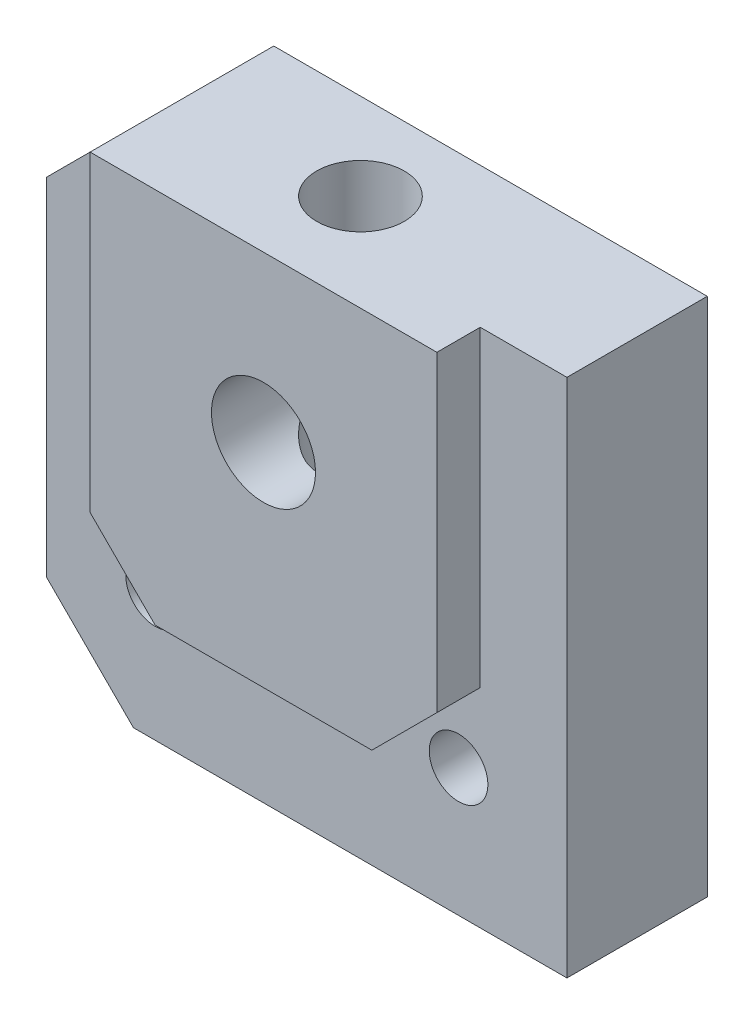
ISO-10303-21;
HEADER;
FILE_DESCRIPTION(('STEP AP214'),'2;1');
FILE_NAME('part.step','',(''),(''),'','','');
FILE_SCHEMA(('AUTOMOTIVE_DESIGN { 1 0 10303 214 1 1 1 1 }'));
ENDSEC;
DATA;
#1=APPLICATION_CONTEXT('core data for automotive mechanical design processes');
#2=APPLICATION_PROTOCOL_DEFINITION('international standard','automotive_design',2000,#1);
#3=PRODUCT_CONTEXT('',#1,'mechanical');
#4=PRODUCT('Part','Part','',(#3));
#5=PRODUCT_RELATED_PRODUCT_CATEGORY('part','',(#4));
#6=PRODUCT_DEFINITION_FORMATION('','',#4);
#7=PRODUCT_DEFINITION_CONTEXT('part definition',#1,'design');
#8=PRODUCT_DEFINITION('design','',#6,#7);
#9=PRODUCT_DEFINITION_SHAPE('','',#8);
#10=(LENGTH_UNIT() NAMED_UNIT(*) SI_UNIT(.MILLI.,.METRE.));
#11=(NAMED_UNIT(*) PLANE_ANGLE_UNIT() SI_UNIT($,.RADIAN.));
#12=(NAMED_UNIT(*) SI_UNIT($,.STERADIAN.) SOLID_ANGLE_UNIT());
#13=UNCERTAINTY_MEASURE_WITH_UNIT(LENGTH_MEASURE(1.E-05),#10,'distance_accuracy_value','');
#14=(GEOMETRIC_REPRESENTATION_CONTEXT(3) GLOBAL_UNCERTAINTY_ASSIGNED_CONTEXT((#13)) GLOBAL_UNIT_ASSIGNED_CONTEXT((#10,
#11,#12)) REPRESENTATION_CONTEXT('',''));
#15=CARTESIAN_POINT('',(0.,0.,0.));
#16=DIRECTION('',(0.,0.,1.));
#17=DIRECTION('',(1.,0.,0.));
#18=AXIS2_PLACEMENT_3D('',#15,#16,#17);
#19=CARTESIAN_POINT('',(0.,0.,8.474));
#20=DIRECTION('',(0.,0.,-1.));
#21=DIRECTION('',(-1.,0.,0.));
#22=AXIS2_PLACEMENT_3D('',#19,#20,#21);
#23=PLANE('',#22);
#24=CARTESIAN_POINT('',(0.,0.,8.474));
#25=DIRECTION('',(0.,0.,1.));
#26=DIRECTION('',(1.,0.,0.));
#27=AXIS2_PLACEMENT_3D('',#24,#25,#26);
#28=CIRCLE('',#27,2.40000000001474);
#29=CARTESIAN_POINT('',(2.40000000001474,0.,8.474));
#30=VERTEX_POINT('',#29);
#31=EDGE_CURVE('E213',#30,#30,#28,.T.);
#32=ORIENTED_EDGE('',*,*,#31,.F.);
#33=EDGE_LOOP('',(#32));
#34=FACE_BOUND('',#33,.T.);
#35=DIRECTION('',(0.,-1.,0.));
#36=VECTOR('',#35,1.);
#37=CARTESIAN_POINT('',(-7.99999999999998,13.,8.474));
#38=LINE('',#37,#36);
#39=CARTESIAN_POINT('',(-7.99999999999998,7.59999999999998,8.474));
#40=VERTEX_POINT('',#39);
#41=CARTESIAN_POINT('',(-7.99999999999998,-6.7979589711327,8.474));
#42=VERTEX_POINT('',#41);
#43=EDGE_CURVE('E185',#40,#42,#38,.T.);
#44=ORIENTED_EDGE('',*,*,#43,.T.);
#45=DIRECTION('',(0.707106781186546,-0.707106781186549,0.));
#46=VECTOR('',#45,1.);
#47=CARTESIAN_POINT('',(-7.99999999999998,-6.7979589711327,8.474));
#48=LINE('',#47,#46);
#49=CARTESIAN_POINT('',(-4.99999999999998,-9.79795897113271,8.474));
#50=VERTEX_POINT('',#49);
#51=EDGE_CURVE('E188',#42,#50,#48,.T.);
#52=ORIENTED_EDGE('',*,*,#51,.T.);
#53=DIRECTION('',(1.,0.,0.));
#54=VECTOR('',#53,1.);
#55=CARTESIAN_POINT('',(-4.99999999999998,-9.79795897113271,8.474));
#56=LINE('',#55,#54);
#57=CARTESIAN_POINT('',(4.99999999999998,-9.79795897113271,8.474));
#58=VERTEX_POINT('',#57);
#59=EDGE_CURVE('E191',#50,#58,#56,.T.);
#60=ORIENTED_EDGE('',*,*,#59,.T.);
#61=DIRECTION('',(0.707106781186549,0.707106781186546,0.));
#62=VECTOR('',#61,1.);
#63=CARTESIAN_POINT('',(4.99999999999998,-9.79795897113271,8.474));
#64=LINE('',#63,#62);
#65=CARTESIAN_POINT('',(7.99999999999998,-6.79795897113271,8.474));
#66=VERTEX_POINT('',#65);
#67=EDGE_CURVE('E194',#58,#66,#64,.T.);
#68=ORIENTED_EDGE('',*,*,#67,.T.);
#69=DIRECTION('',(0.,1.,0.));
#70=VECTOR('',#69,1.);
#71=CARTESIAN_POINT('',(7.99999999999998,13.,8.474));
#72=LINE('',#71,#70);
#73=CARTESIAN_POINT('',(7.99999999999998,7.59999999999997,8.474));
#74=VERTEX_POINT('',#73);
#75=EDGE_CURVE('E172',#66,#74,#72,.T.);
#76=ORIENTED_EDGE('',*,*,#75,.T.);
#77=DIRECTION('',(-1.,0.,0.));
#78=VECTOR('',#77,1.);
#79=CARTESIAN_POINT('',(12.,7.59999999999997,8.474));
#80=LINE('',#79,#78);
#81=EDGE_CURVE('E219',#74,#40,#80,.T.);
#82=ORIENTED_EDGE('',*,*,#81,.T.);
#83=EDGE_LOOP('',(#44,#52,#60,#68,#76,#82));
#84=FACE_BOUND('',#83,.T.);
#85=ADVANCED_FACE('F51',(#34,#84),#23,.F.);
#86=CARTESIAN_POINT('',(12.,7.59999999999997,8.474));
#87=DIRECTION('',(-1.,0.,0.));
#88=DIRECTION('',(0.,-1.,0.));
#89=AXIS2_PLACEMENT_3D('',#86,#87,#88);
#90=PLANE('',#89);
#91=DIRECTION('',(0.,1.,0.));
#92=VECTOR('',#91,1.);
#93=CARTESIAN_POINT('',(12.,7.59999999999997,6.474));
#94=LINE('',#93,#92);
#95=CARTESIAN_POINT('',(12.,-16.4,6.474));
#96=VERTEX_POINT('',#95);
#97=CARTESIAN_POINT('',(12.,7.59999999999997,6.474));
#98=VERTEX_POINT('',#97);
#99=EDGE_CURVE('E208',#96,#98,#94,.T.);
#100=ORIENTED_EDGE('',*,*,#99,.F.);
#101=DIRECTION('',(0.,0.,-1.));
#102=VECTOR('',#101,1.);
#103=CARTESIAN_POINT('',(12.,-16.4,8.474));
#104=LINE('',#103,#102);
#105=CARTESIAN_POINT('',(12.,-16.4,0.));
#106=VERTEX_POINT('',#105);
#107=EDGE_CURVE('E222',#96,#106,#104,.T.);
#108=ORIENTED_EDGE('',*,*,#107,.T.);
#109=DIRECTION('',(0.,1.,0.));
#110=VECTOR('',#109,1.);
#111=CARTESIAN_POINT('',(12.,7.59999999999997,0.));
#112=LINE('',#111,#110);
#113=CARTESIAN_POINT('',(12.,7.59999999999997,0.));
#114=VERTEX_POINT('',#113);
#115=EDGE_CURVE('E216',#106,#114,#112,.T.);
#116=ORIENTED_EDGE('',*,*,#115,.T.);
#117=DIRECTION('',(0.,0.,-1.));
#118=VECTOR('',#117,1.);
#119=CARTESIAN_POINT('',(12.,7.59999999999997,8.474));
#120=LINE('',#119,#118);
#121=EDGE_CURVE('E234',#98,#114,#120,.T.);
#122=ORIENTED_EDGE('',*,*,#121,.F.);
#123=EDGE_LOOP('',(#100,#108,#116,#122));
#124=FACE_BOUND('',#123,.T.);
#125=ADVANCED_FACE('F307',(#124),#90,.F.);
#126=CARTESIAN_POINT('',(12.,7.59999999999997,8.474));
#127=DIRECTION('',(0.,-1.,0.));
#128=DIRECTION('',(1.,0.,0.));
#129=AXIS2_PLACEMENT_3D('',#126,#127,#128);
#130=PLANE('',#129);
#131=CARTESIAN_POINT('',(0.,7.59999999999998,4.));
#132=DIRECTION('',(0.,1.,0.));
#133=DIRECTION('',(0.,0.,1.));
#134=AXIS2_PLACEMENT_3D('',#131,#132,#133);
#135=CIRCLE('',#134,2.01929999999999);
#136=CARTESIAN_POINT('',(0.,7.59999999999998,6.01929999999999));
#137=VERTEX_POINT('',#136);
#138=EDGE_CURVE('E155',#137,#137,#135,.T.);
#139=ORIENTED_EDGE('',*,*,#138,.F.);
#140=EDGE_LOOP('',(#139));
#141=FACE_BOUND('',#140,.T.);
#142=DIRECTION('',(-1.,0.,0.));
#143=VECTOR('',#142,1.);
#144=CARTESIAN_POINT('',(12.,7.59999999999997,0.));
#145=LINE('',#144,#143);
#146=CARTESIAN_POINT('',(-7.99999999999997,7.59999999999998,0.));
#147=VERTEX_POINT('',#146);
#148=EDGE_CURVE('E226',#114,#147,#145,.T.);
#149=ORIENTED_EDGE('',*,*,#148,.T.);
#150=DIRECTION('',(0.,0.,1.));
#151=VECTOR('',#150,1.);
#152=CARTESIAN_POINT('',(-7.99999999999997,7.59999999999998,8.474));
#153=LINE('',#152,#151);
#154=CARTESIAN_POINT('',(-7.99999999999998,7.59999999999998,6.474));
#155=VERTEX_POINT('',#154);
#156=EDGE_CURVE('E13',#147,#155,#153,.T.);
#157=ORIENTED_EDGE('',*,*,#156,.T.);
#158=DIRECTION('',(0.,0.,-1.));
#159=VECTOR('',#158,1.);
#160=CARTESIAN_POINT('',(-7.99999999999998,7.59999999999998,8.474));
#161=LINE('',#160,#159);
#162=EDGE_CURVE('E240',#40,#155,#161,.T.);
#163=ORIENTED_EDGE('',*,*,#162,.F.);
#164=ORIENTED_EDGE('',*,*,#81,.F.);
#165=DIRECTION('',(0.,0.,1.));
#166=VECTOR('',#165,1.);
#167=CARTESIAN_POINT('',(7.99999999999998,7.59999999999997,8.474));
#168=LINE('',#167,#166);
#169=CARTESIAN_POINT('',(7.99999999999998,7.59999999999997,6.474));
#170=VERTEX_POINT('',#169);
#171=EDGE_CURVE('E238',#170,#74,#168,.T.);
#172=ORIENTED_EDGE('',*,*,#171,.F.);
#173=DIRECTION('',(-1.,0.,0.));
#174=VECTOR('',#173,1.);
#175=CARTESIAN_POINT('',(12.,7.59999999999997,6.474));
#176=LINE('',#175,#174);
#177=EDGE_CURVE('E209',#98,#170,#176,.T.);
#178=ORIENTED_EDGE('',*,*,#177,.F.);
#179=ORIENTED_EDGE('',*,*,#121,.T.);
#180=EDGE_LOOP('',(#149,#157,#163,#164,#172,#178,#179));
#181=FACE_BOUND('',#180,.T.);
#182=ADVANCED_FACE('F312',(#141,#181),#130,.F.);
#183=CARTESIAN_POINT('',(-12.,7.59999999999999,8.474));
#184=DIRECTION('',(1.,0.,0.));
#185=DIRECTION('',(0.,0.,-1.));
#186=AXIS2_PLACEMENT_3D('',#183,#184,#185);
#187=PLANE('',#186);
#188=DIRECTION('',(0.,-1.,0.));
#189=VECTOR('',#188,1.);
#190=CARTESIAN_POINT('',(-12.,7.59999999999999,0.));
#191=LINE('',#190,#189);
#192=CARTESIAN_POINT('',(-12.,3.59999999999999,0.));
#193=VERTEX_POINT('',#192);
#194=CARTESIAN_POINT('',(-12.,-12.4,0.));
#195=VERTEX_POINT('',#194);
#196=EDGE_CURVE('E229',#193,#195,#191,.T.);
#197=ORIENTED_EDGE('',*,*,#196,.T.);
#198=DIRECTION('',(0.,0.,1.));
#199=VECTOR('',#198,1.);
#200=CARTESIAN_POINT('',(-12.,-12.4,8.474));
#201=LINE('',#200,#199);
#202=CARTESIAN_POINT('',(-12.,-12.4,6.474));
#203=VERTEX_POINT('',#202);
#204=EDGE_CURVE('E72',#195,#203,#201,.T.);
#205=ORIENTED_EDGE('',*,*,#204,.T.);
#206=DIRECTION('',(0.,-1.,0.));
#207=VECTOR('',#206,1.);
#208=CARTESIAN_POINT('',(-12.,7.59999999999999,6.474));
#209=LINE('',#208,#207);
#210=CARTESIAN_POINT('',(-12.,3.59999999999999,6.474));
#211=VERTEX_POINT('',#210);
#212=EDGE_CURVE('E201',#211,#203,#209,.T.);
#213=ORIENTED_EDGE('',*,*,#212,.F.);
#214=DIRECTION('',(0.,0.,-1.));
#215=VECTOR('',#214,1.);
#216=CARTESIAN_POINT('',(-12.,3.59999999999999,8.474));
#217=LINE('',#216,#215);
#218=EDGE_CURVE('E254',#211,#193,#217,.T.);
#219=ORIENTED_EDGE('',*,*,#218,.T.);
#220=EDGE_LOOP('',(#197,#205,#213,#219));
#221=FACE_BOUND('',#220,.T.);
#222=ADVANCED_FACE('F325',(#221),#187,.F.);
#223=CARTESIAN_POINT('',(12.,-16.4,8.474));
#224=DIRECTION('',(0.,1.,0.));
#225=DIRECTION('',(0.,0.,1.));
#226=AXIS2_PLACEMENT_3D('',#223,#224,#225);
#227=PLANE('',#226);
#228=DIRECTION('',(1.,0.,0.));
#229=VECTOR('',#228,1.);
#230=CARTESIAN_POINT('',(12.,-16.4,6.474));
#231=LINE('',#230,#229);
#232=CARTESIAN_POINT('',(-7.99999999999998,-16.4,6.474));
#233=VERTEX_POINT('',#232);
#234=EDGE_CURVE('E236',#233,#96,#231,.T.);
#235=ORIENTED_EDGE('',*,*,#234,.F.);
#236=DIRECTION('',(0.,0.,-1.));
#237=VECTOR('',#236,1.);
#238=CARTESIAN_POINT('',(-7.99999999999998,-16.4,8.474));
#239=LINE('',#238,#237);
#240=CARTESIAN_POINT('',(-7.99999999999998,-16.4,0.));
#241=VERTEX_POINT('',#240);
#242=EDGE_CURVE('E243',#233,#241,#239,.T.);
#243=ORIENTED_EDGE('',*,*,#242,.T.);
#244=DIRECTION('',(1.,0.,0.));
#245=VECTOR('',#244,1.);
#246=CARTESIAN_POINT('',(12.,-16.4,0.));
#247=LINE('',#246,#245);
#248=EDGE_CURVE('E223',#241,#106,#247,.T.);
#249=ORIENTED_EDGE('',*,*,#248,.T.);
#250=ORIENTED_EDGE('',*,*,#107,.F.);
#251=EDGE_LOOP('',(#235,#243,#249,#250));
#252=FACE_BOUND('',#251,.T.);
#253=ADVANCED_FACE('F321',(#252),#227,.F.);
#254=CARTESIAN_POINT('',(0.,0.,0.));
#255=DIRECTION('',(0.,0.,-1.));
#256=DIRECTION('',(-1.,0.,0.));
#257=AXIS2_PLACEMENT_3D('',#254,#255,#256);
#258=PLANE('',#257);
#259=CARTESIAN_POINT('',(7.,-10.5,0.));
#260=DIRECTION('',(0.,0.,-1.));
#261=DIRECTION('',(-1.,0.,0.));
#262=AXIS2_PLACEMENT_3D('',#259,#260,#261);
#263=CIRCLE('',#262,1.35255);
#264=CARTESIAN_POINT('',(5.64745,-10.5,0.));
#265=VERTEX_POINT('',#264);
#266=EDGE_CURVE('E161',#265,#265,#263,.T.);
#267=ORIENTED_EDGE('',*,*,#266,.F.);
#268=EDGE_LOOP('',(#267));
#269=FACE_BOUND('',#268,.T.);
#270=CARTESIAN_POINT('',(-7.,-10.5,0.));
#271=DIRECTION('',(0.,0.,-1.));
#272=DIRECTION('',(-1.,0.,0.));
#273=AXIS2_PLACEMENT_3D('',#270,#271,#272);
#274=CIRCLE('',#273,1.35255);
#275=CARTESIAN_POINT('',(-8.35255,-10.5,0.));
#276=VERTEX_POINT('',#275);
#277=EDGE_CURVE('E165',#276,#276,#274,.T.);
#278=ORIENTED_EDGE('',*,*,#277,.F.);
#279=EDGE_LOOP('',(#278));
#280=FACE_BOUND('',#279,.T.);
#281=ORIENTED_EDGE('',*,*,#248,.F.);
#282=DIRECTION('',(0.707106781186546,-0.707106781186549,0.));
#283=VECTOR('',#282,1.);
#284=CARTESIAN_POINT('',(-12.2,-12.2,0.));
#285=LINE('',#284,#283);
#286=EDGE_CURVE('E252',#241,#195,#285,.F.);
#287=ORIENTED_EDGE('',*,*,#286,.T.);
#288=ORIENTED_EDGE('',*,*,#196,.F.);
#289=DIRECTION('',(-0.707106781186549,-0.707106781186546,0.));
#290=VECTOR('',#289,1.);
#291=CARTESIAN_POINT('',(-7.79999999999995,7.8,0.));
#292=LINE('',#291,#290);
#293=EDGE_CURVE('E250',#193,#147,#292,.F.);
#294=ORIENTED_EDGE('',*,*,#293,.T.);
#295=ORIENTED_EDGE('',*,*,#148,.F.);
#296=ORIENTED_EDGE('',*,*,#115,.F.);
#297=EDGE_LOOP('',(#281,#287,#288,#294,#295,#296));
#298=FACE_BOUND('',#297,.T.);
#299=CARTESIAN_POINT('',(0.,0.,0.));
#300=DIRECTION('',(0.,0.,1.));
#301=DIRECTION('',(1.,0.,0.));
#302=AXIS2_PLACEMENT_3D('',#299,#300,#301);
#303=CIRCLE('',#302,2.40000000001474);
#304=CARTESIAN_POINT('',(2.40000000001474,0.,0.));
#305=VERTEX_POINT('',#304);
#306=EDGE_CURVE('E211',#305,#305,#303,.T.);
#307=ORIENTED_EDGE('',*,*,#306,.T.);
#308=EDGE_LOOP('',(#307));
#309=FACE_BOUND('',#308,.T.);
#310=ADVANCED_FACE('F318',(#269,#280,#298,#309),#258,.T.);
#311=CARTESIAN_POINT('',(0.,0.,8.474));
#312=DIRECTION('',(0.,0.,-1.));
#313=DIRECTION('',(-1.,0.,0.));
#314=AXIS2_PLACEMENT_3D('',#311,#312,#313);
#315=CYLINDRICAL_SURFACE('',#314,2.40000000001474);
#316=CARTESIAN_POINT('',(0.,-2.40000000001474,6.01929999999999));
#317=CARTESIAN_POINT('',(0.095515806575951,-2.39999238543372,6.01929221438411));
#318=CARTESIAN_POINT('',(0.191167454001412,-2.39423989616671,6.01246436017616));
#319=CARTESIAN_POINT('',(0.379363476530387,-2.37173268519024,5.98563326159343));
#320=CARTESIAN_POINT('',(0.471900609705637,-2.35495396390918,5.96560127696846));
#321=CARTESIAN_POINT('',(0.650591581200549,-2.31195203669211,5.913870540468));
#322=CARTESIAN_POINT('',(0.736783118349506,-2.28579114733798,5.88224873867719));
#323=CARTESIAN_POINT('',(0.901839017647634,-2.22585129178469,5.80898512775976));
#324=CARTESIAN_POINT('',(0.980703096779482,-2.19207203150447,5.76734293182609));
#325=CARTESIAN_POINT('',(1.15822342741219,-2.10512985214821,5.65849267664665));
#326=CARTESIAN_POINT('',(1.25333955984349,-2.0494291381466,5.58753523911078));
#327=CARTESIAN_POINT('',(1.42799030186576,-1.93183579187943,5.43252444040202));
#328=CARTESIAN_POINT('',(1.50747983641642,-1.86992600329137,5.34843441475954));
#329=CARTESIAN_POINT('',(1.65215017637162,-1.74348499796233,5.16692512362653));
#330=CARTESIAN_POINT('',(1.71702808516537,-1.67892628843821,5.06928159596786));
#331=CARTESIAN_POINT('',(1.80167169364464,-1.58611138770857,4.91378938423302));
#332=CARTESIAN_POINT('',(1.82776020847933,-1.55586334635722,4.86049453991717));
#333=CARTESIAN_POINT('',(1.87554046801345,-1.49791531667579,4.75067089529475));
#334=CARTESIAN_POINT('',(1.89723591102484,-1.47021319588131,4.69414486700945));
#335=CARTESIAN_POINT('',(1.93745111641643,-1.41685835571226,4.5729343124616));
#336=CARTESIAN_POINT('',(1.95557316052742,-1.39155157879647,4.50795954223223));
#337=CARTESIAN_POINT('',(1.98550062366291,-1.34850999004181,4.37421247023415));
#338=CARTESIAN_POINT('',(1.99732084113381,-1.33075745871027,4.3054494873488));
#339=CARTESIAN_POINT('',(2.0138844636632,-1.30557190620317,4.16414844381204));
#340=CARTESIAN_POINT('',(2.01853307775266,-1.29827719926311,4.09157271503059));
#341=CARTESIAN_POINT('',(2.01989049846235,-1.29616590438357,3.94617620069229));
#342=CARTESIAN_POINT('',(2.01660174731657,-1.30134547825346,3.87335549739606));
#343=CARTESIAN_POINT('',(2.00207057508707,-1.32358716390565,3.72591491051528));
#344=CARTESIAN_POINT('',(1.99035611235574,-1.34135350438395,3.65145540444652));
#345=CARTESIAN_POINT('',(1.95955127883291,-1.3859586383232,3.50680724272931));
#346=CARTESIAN_POINT('',(1.94043571241656,-1.41282838308942,3.43663413444471));
#347=CARTESIAN_POINT('',(1.90015210897456,-1.46639651885375,3.31421830099689));
#348=CARTESIAN_POINT('',(1.88011224720841,-1.49210543722442,3.2611485503438));
#349=CARTESIAN_POINT('',(1.83616743662695,-1.54586515567458,3.15785326142955));
#350=CARTESIAN_POINT('',(1.81226010238599,-1.57391739589828,3.10762950453633));
#351=CARTESIAN_POINT('',(1.73496929924693,-1.66006206661401,2.96090942325708));
#352=CARTESIAN_POINT('',(1.67603988617209,-1.72010997108842,2.86843177764879));
#353=CARTESIAN_POINT('',(1.53994596665811,-1.8432409123066,2.68866675528982));
#354=CARTESIAN_POINT('',(1.46189565903394,-1.9062884396359,2.6020293400896));
#355=CARTESIAN_POINT('',(1.28974796613846,-2.02670755310899,2.44183339586713));
#356=CARTESIAN_POINT('',(1.19568295620229,-2.08409022865992,2.36824907976649));
#357=CARTESIAN_POINT('',(1.01474669256661,-2.17673754188165,2.25165756965236));
#358=CARTESIAN_POINT('',(0.930981965201169,-2.21407757967965,2.20549313875462));
#359=CARTESIAN_POINT('',(0.754881251836189,-2.2801259356764,2.12460833483959));
#360=CARTESIAN_POINT('',(0.66255000987034,-2.30883899449035,2.08988167563384));
#361=CARTESIAN_POINT('',(0.470384550169772,-2.35554303611097,2.03368314402374));
#362=CARTESIAN_POINT('',(0.370494388150166,-2.37344299083155,2.0123237488372));
#363=CARTESIAN_POINT('',(0.16719230823242,-2.39634663479931,1.98502924868625));
#364=CARTESIAN_POINT('',(0.0637834686104012,-2.40136131689385,1.97908099593633));
#365=CARTESIAN_POINT('',(-0.128923057933557,-2.39821487689913,1.98282259478685));
#366=CARTESIAN_POINT('',(-0.218295508409674,-2.39169299533282,1.99056680256468));
#367=CARTESIAN_POINT('',(-0.394028707495322,-2.36909045441096,2.0175227506781));
#368=CARTESIAN_POINT('',(-0.480389221411706,-2.35300905192178,2.03673538254126));
#369=CARTESIAN_POINT('',(-0.647874434403731,-2.31250497247711,2.08546742419195));
#370=CARTESIAN_POINT('',(-0.729007330013393,-2.28809575096059,2.11497020965842));
#371=CARTESIAN_POINT('',(-0.884887962758847,-2.23245089688435,2.18291796690811));
#372=CARTESIAN_POINT('',(-0.95963311401919,-2.20121251779411,2.22136653688176));
#373=CARTESIAN_POINT('',(-1.13360356632858,-2.11845974108613,2.3246510309992));
#374=CARTESIAN_POINT('',(-1.22901977041938,-2.06409093591167,2.39363378934117));
#375=CARTESIAN_POINT('',(-1.40460046545318,-1.94889357959279,2.54461267111211));
#376=CARTESIAN_POINT('',(-1.48472218486424,-1.88804763324455,2.6266441458819));
#377=CARTESIAN_POINT('',(-1.63094901499349,-1.76333483461633,2.80374735715612));
#378=CARTESIAN_POINT('',(-1.69676901228637,-1.69943299390209,2.8990313102272));
#379=CARTESIAN_POINT('',(-1.78319828370191,-1.60686079554109,3.05071431266565));
#380=CARTESIAN_POINT('',(-1.80994713107631,-1.57656515799218,3.10270532373674));
#381=CARTESIAN_POINT('',(-1.85920556812731,-1.51815914122339,3.20980884514372));
#382=CARTESIAN_POINT('',(-1.88171814854143,-1.49004722862381,3.26491911730453));
#383=CARTESIAN_POINT('',(-1.9246496633779,-1.43426117157025,3.38530077103245));
#384=CARTESIAN_POINT('',(-1.94449310139746,-1.40704444532648,3.45099786602251));
#385=CARTESIAN_POINT('',(-1.9777320365961,-1.35993042778868,3.58648460978336));
#386=CARTESIAN_POINT('',(-1.99114083176968,-1.34001806137396,3.65626548092538));
#387=CARTESIAN_POINT('',(-2.01071522069529,-1.31048165718011,3.80019197841746));
#388=CARTESIAN_POINT('',(-2.01677268077945,-1.30101139683752,3.8743863105425));
#389=CARTESIAN_POINT('',(-2.0205356985127,-1.29516676213659,4.02348123395472));
#390=CARTESIAN_POINT('',(-2.01824910265873,-1.29878008434964,4.09838109569257));
#391=CARTESIAN_POINT('',(-2.00663097702231,-1.31662648441629,4.23440957738781));
#392=CARTESIAN_POINT('',(-1.99843688102327,-1.32914102285686,4.29588469761231));
#393=CARTESIAN_POINT('',(-1.97690077853916,-1.36096873626906,4.4161409081737));
#394=CARTESIAN_POINT('',(-1.96355023535768,-1.38029318062917,4.4749173492407));
#395=CARTESIAN_POINT('',(-1.92001537160756,-1.44075679281409,4.6343182833008));
#396=CARTESIAN_POINT('',(-1.88484381235871,-1.48711161445016,4.73156985347301));
#397=CARTESIAN_POINT('',(-1.80200279515557,-1.58651203591494,4.91689980798695));
#398=CARTESIAN_POINT('',(-1.75429666221834,-1.6395770287506,5.00495019605795));
#399=CARTESIAN_POINT('',(-1.64329157536873,-1.75106058126119,5.17833405518218));
#400=CARTESIAN_POINT('',(-1.57913524614213,-1.80959395635632,5.2630465059802));
#401=CARTESIAN_POINT('',(-1.43741685291459,-1.92409234813214,5.42222879504097));
#402=CARTESIAN_POINT('',(-1.35987193613533,-1.98006053551149,5.49671151843145));
#403=CARTESIAN_POINT('',(-1.19827371446766,-2.08146097529648,5.62839044351957));
#404=CARTESIAN_POINT('',(-1.11528361289527,-2.12738140542616,5.68650543888242));
#405=CARTESIAN_POINT('',(-0.93838515232016,-2.21110273567438,5.79095550304662));
#406=CARTESIAN_POINT('',(-0.844483701639037,-2.24890873058964,5.83729796682296));
#407=CARTESIAN_POINT('',(-0.663493123246513,-2.30809584396627,5.90924650086617));
#408=CARTESIAN_POINT('',(-0.577812066694146,-2.33115376492544,5.93700684783397));
#409=CARTESIAN_POINT('',(-0.401704366797363,-2.36784057337514,5.98100766649029));
#410=CARTESIAN_POINT('',(-0.311290224211291,-2.38149307159293,5.99727698707505));
#411=CARTESIAN_POINT('',(-0.183419709396613,-2.39326222749427,6.01128805801167));
#412=CARTESIAN_POINT('',(-0.146855203906802,-2.39578364432501,6.01428722481819));
#413=CARTESIAN_POINT('',(-0.0735338709330461,-2.39915417137352,6.01829490281228));
#414=CARTESIAN_POINT('',(-0.0367770048437777,-2.40000293190102,6.01930299774081));
#415=CARTESIAN_POINT('',(0.,-2.40000000001474,6.01929999999999));
#416=B_SPLINE_CURVE_WITH_KNOTS('',3,(#316,#317,#318,#319,#320,#321,#322,#323,#324,#325,#326,
#327,#328,#329,#330,#331,#332,#333,#334,#335,#336,#337,#338,#339,#340,#341,#342,#343,#344,#345,
#346,#347,#348,#349,#350,#351,#352,#353,#354,#355,#356,#357,#358,#359,#360,#361,#362,#363,#364,
#365,#366,#367,#368,#369,#370,#371,#372,#373,#374,#375,#376,#377,#378,#379,#380,#381,#382,#383,
#384,#385,#386,#387,#388,#389,#390,#391,#392,#393,#394,#395,#396,#397,#398,#399,#400,#401,#402,
#403,#404,#405,#406,#407,#408,#409,#410,#411,#412,#413,#414,#415),.UNSPECIFIED.,.T.,.F.,(4,2,2,
2,2,2,2,2,2,2,2,2,2,2,2,2,2,2,2,2,2,2,2,2,2,2,2,2,2,2,2,2,2,2,2,2,2,2,2,2,2,2,2,2,2,2,2,2,2,4),
(0.,0.286385067325085,0.573395550967072,0.858533975657922,1.14368340902263,1.53482977501259,
1.92708836373785,2.32685268777473,2.52645613361672,2.72589083800825,2.94142438750411,
3.15644954957109,3.37429317896865,3.59206978898749,3.82310497246485,4.05493368586403,
4.24152961614454,4.42824107920047,4.80189633633824,5.19809972102901,5.59351145026026,
5.90037220618285,6.20706402920649,6.51630295023066,6.8252779616932,7.09379633551671,
7.36233558602824,7.63044299059713,7.89865842083171,8.28559776037711,8.67360382535722,
9.06875107309334,9.26611818102155,9.46334542378978,9.68424198048891,9.90468003956474,
10.1283227696897,10.3517552471979,10.5408285734389,10.730216268901,11.0682888180172,
11.4073617692401,11.7701560562334,12.1324891008886,12.4649583747375,12.7972182870296,
13.0749914701825,13.3520647845217,13.4623102417816,13.5725787448259),.UNSPECIFIED.);
#417=CARTESIAN_POINT('',(0.,-2.40000000001474,6.01929999999999));
#418=VERTEX_POINT('',#417);
#419=EDGE_CURVE('E55',#418,#418,#416,.T.);
#420=ORIENTED_EDGE('',*,*,#419,.F.);
#421=EDGE_LOOP('',(#420));
#422=FACE_BOUND('',#421,.T.);
#423=CARTESIAN_POINT('',(0.,2.40000000001474,6.01929999999999));
#424=CARTESIAN_POINT('',(-0.0955158065759421,2.39999238543372,6.01929221438411));
#425=CARTESIAN_POINT('',(-0.191167454001403,2.39423989616671,6.01246436017616));
#426=CARTESIAN_POINT('',(-0.379363476530377,2.37173268519024,5.98563326159343));
#427=CARTESIAN_POINT('',(-0.471900609705627,2.35495396390918,5.96560127696846));
#428=CARTESIAN_POINT('',(-0.650591581200539,2.31195203669211,5.913870540468));
#429=CARTESIAN_POINT('',(-0.736783118349497,2.28579114733799,5.88224873867719));
#430=CARTESIAN_POINT('',(-0.901839017647624,2.22585129178469,5.80898512775976));
#431=CARTESIAN_POINT('',(-0.980703096779472,2.19207203150448,5.76734293182609));
#432=CARTESIAN_POINT('',(-1.15822342741218,2.10512985214822,5.65849267664665));
#433=CARTESIAN_POINT('',(-1.25333955984348,2.0494291381466,5.58753523911079));
#434=CARTESIAN_POINT('',(-1.42799030186575,1.93183579187944,5.43252444040202));
#435=CARTESIAN_POINT('',(-1.50747983641641,1.86992600329138,5.34843441475954));
#436=CARTESIAN_POINT('',(-1.65215017637161,1.74348499796234,5.16692512362654));
#437=CARTESIAN_POINT('',(-1.71702808516536,1.67892628843822,5.06928159596786));
#438=CARTESIAN_POINT('',(-1.80167169364463,1.58611138770858,4.91378938423302));
#439=CARTESIAN_POINT('',(-1.82776020847931,1.55586334635723,4.86049453991718));
#440=CARTESIAN_POINT('',(-1.87554046801344,1.4979153166758,4.75067089529475));
#441=CARTESIAN_POINT('',(-1.89723591102483,1.47021319588132,4.69414486700945));
#442=CARTESIAN_POINT('',(-1.93745111641642,1.41685835571228,4.57293431246161));
#443=CARTESIAN_POINT('',(-1.95557316052741,1.39155157879649,4.50795954223224));
#444=CARTESIAN_POINT('',(-1.9855006236629,1.34850999004183,4.37421247023415));
#445=CARTESIAN_POINT('',(-1.99732084113381,1.33075745871028,4.30544948734881));
#446=CARTESIAN_POINT('',(-2.01388446366319,1.30557190620318,4.16414844381204));
#447=CARTESIAN_POINT('',(-2.01853307775265,1.29827719926312,4.09157271503059));
#448=CARTESIAN_POINT('',(-2.01989049846234,1.29616590438358,3.94617620069229));
#449=CARTESIAN_POINT('',(-2.01660174731656,1.30134547825347,3.87335549739606));
#450=CARTESIAN_POINT('',(-2.00207057508706,1.32358716390567,3.72591491051528));
#451=CARTESIAN_POINT('',(-1.99035611235573,1.34135350438396,3.65145540444652));
#452=CARTESIAN_POINT('',(-1.9595512788329,1.38595863832322,3.5068072427293));
#453=CARTESIAN_POINT('',(-1.94043571241655,1.41282838308944,3.43663413444471));
#454=CARTESIAN_POINT('',(-1.90015210897455,1.46639651885376,3.31421830099689));
#455=CARTESIAN_POINT('',(-1.8801122472084,1.49210543722444,3.26114855034379));
#456=CARTESIAN_POINT('',(-1.83616743662694,1.5458651556746,3.15785326142954));
#457=CARTESIAN_POINT('',(-1.81226010238598,1.5739173958983,3.10762950453632));
#458=CARTESIAN_POINT('',(-1.73496929924691,1.66006206661403,2.96090942325707));
#459=CARTESIAN_POINT('',(-1.67603988617208,1.72010997108844,2.86843177764878));
#460=CARTESIAN_POINT('',(-1.5399459666581,1.84324091230661,2.68866675528981));
#461=CARTESIAN_POINT('',(-1.46189565903392,1.90628843963591,2.60202934008959));
#462=CARTESIAN_POINT('',(-1.28974796613844,2.02670755310901,2.44183339586712));
#463=CARTESIAN_POINT('',(-1.19568295620227,2.08409022865993,2.36824907976648));
#464=CARTESIAN_POINT('',(-1.01474669256659,2.17673754188166,2.25165756965235));
#465=CARTESIAN_POINT('',(-0.930981965201147,2.21407757967965,2.20549313875462));
#466=CARTESIAN_POINT('',(-0.754881251836167,2.28012593567641,2.12460833483958));
#467=CARTESIAN_POINT('',(-0.662550009870319,2.30883899449036,2.08988167563384));
#468=CARTESIAN_POINT('',(-0.470384550169751,2.35554303611097,2.03368314402374));
#469=CARTESIAN_POINT('',(-0.370494388150146,2.37344299083155,2.0123237488372));
#470=CARTESIAN_POINT('',(-0.167192308232401,2.39634663479931,1.98502924868625));
#471=CARTESIAN_POINT('',(-0.0637834686103825,2.40136131689385,1.97908099593633));
#472=CARTESIAN_POINT('',(0.128923057933575,2.39821487689913,1.98282259478685));
#473=CARTESIAN_POINT('',(0.218295508409691,2.39169299533282,1.99056680256468));
#474=CARTESIAN_POINT('',(0.394028707495339,2.36909045441096,2.0175227506781));
#475=CARTESIAN_POINT('',(0.480389221411723,2.35300905192178,2.03673538254126));
#476=CARTESIAN_POINT('',(0.647874434403747,2.31250497247711,2.08546742419195));
#477=CARTESIAN_POINT('',(0.729007330013408,2.28809575096059,2.11497020965843));
#478=CARTESIAN_POINT('',(0.884887962758863,2.23245089688435,2.18291796690811));
#479=CARTESIAN_POINT('',(0.959633114019206,2.2012125177941,2.22136653688176));
#480=CARTESIAN_POINT('',(1.13360356632859,2.11845974108612,2.3246510309992));
#481=CARTESIAN_POINT('',(1.22901977041939,2.06409093591166,2.39363378934118));
#482=CARTESIAN_POINT('',(1.4046004654532,1.94889357959278,2.54461267111212));
#483=CARTESIAN_POINT('',(1.48472218486426,1.88804763324454,2.62664414588191));
#484=CARTESIAN_POINT('',(1.63094901499351,1.76333483461631,2.80374735715613));
#485=CARTESIAN_POINT('',(1.69676901228638,1.69943299390208,2.89903131022721));
#486=CARTESIAN_POINT('',(1.78319828370192,1.60686079554107,3.05071431266566));
#487=CARTESIAN_POINT('',(1.80994713107632,1.57656515799216,3.10270532373676));
#488=CARTESIAN_POINT('',(1.85920556812733,1.51815914122338,3.20980884514373));
#489=CARTESIAN_POINT('',(1.88171814854144,1.49004722862379,3.26491911730454));
#490=CARTESIAN_POINT('',(1.92464966337791,1.43426117157023,3.38530077103247));
#491=CARTESIAN_POINT('',(1.94449310139747,1.40704444532646,3.45099786602253));
#492=CARTESIAN_POINT('',(1.97773203659611,1.35993042778867,3.58648460978337));
#493=CARTESIAN_POINT('',(1.99114083176969,1.34001806137395,3.65626548092539));
#494=CARTESIAN_POINT('',(2.0107152206953,1.3104816571801,3.80019197841747));
#495=CARTESIAN_POINT('',(2.01677268077946,1.3010113968375,3.87438631054251));
#496=CARTESIAN_POINT('',(2.02053569851271,1.29516676213657,4.02348123395472));
#497=CARTESIAN_POINT('',(2.01824910265873,1.29878008434962,4.09838109569257));
#498=CARTESIAN_POINT('',(2.00663097702231,1.31662648441628,4.23440957738781));
#499=CARTESIAN_POINT('',(1.99843688102328,1.32914102285685,4.29588469761231));
#500=CARTESIAN_POINT('',(1.97690077853917,1.36096873626905,4.4161409081737));
#501=CARTESIAN_POINT('',(1.96355023535769,1.38029318062916,4.4749173492407));
#502=CARTESIAN_POINT('',(1.92001537160757,1.44075679281408,4.6343182833008));
#503=CARTESIAN_POINT('',(1.88484381235872,1.48711161445015,4.731569853473));
#504=CARTESIAN_POINT('',(1.80200279515558,1.58651203591493,4.91689980798694));
#505=CARTESIAN_POINT('',(1.75429666221835,1.63957702875058,5.00495019605795));
#506=CARTESIAN_POINT('',(1.64329157536875,1.75106058126118,5.17833405518218));
#507=CARTESIAN_POINT('',(1.57913524614214,1.80959395635631,5.26304650598019));
#508=CARTESIAN_POINT('',(1.4374168529146,1.92409234813213,5.42222879504097));
#509=CARTESIAN_POINT('',(1.35987193613534,1.98006053551148,5.49671151843144));
#510=CARTESIAN_POINT('',(1.19827371446767,2.08146097529647,5.62839044351957));
#511=CARTESIAN_POINT('',(1.11528361289529,2.12738140542615,5.68650543888242));
#512=CARTESIAN_POINT('',(0.938385152320173,2.21110273567438,5.79095550304661));
#513=CARTESIAN_POINT('',(0.844483701639049,2.24890873058963,5.83729796682296));
#514=CARTESIAN_POINT('',(0.663493123246527,2.30809584396627,5.90924650086617));
#515=CARTESIAN_POINT('',(0.57781206669416,2.33115376492543,5.93700684783397));
#516=CARTESIAN_POINT('',(0.401704366797377,2.36784057337513,5.98100766649029));
#517=CARTESIAN_POINT('',(0.311290224211304,2.38149307159293,5.99727698707505));
#518=CARTESIAN_POINT('',(0.183419709396625,2.39326222749427,6.01128805801167));
#519=CARTESIAN_POINT('',(0.146855203906813,2.395783644325,6.01428722481819));
#520=CARTESIAN_POINT('',(0.0735338709330557,2.39915417137352,6.01829490281228));
#521=CARTESIAN_POINT('',(0.0367770048437869,2.40000293190102,6.01930299774081));
#522=CARTESIAN_POINT('',(0.,2.40000000001474,6.01929999999999));
#523=B_SPLINE_CURVE_WITH_KNOTS('',3,(#423,#424,#425,#426,#427,#428,#429,#430,#431,#432,#433,
#434,#435,#436,#437,#438,#439,#440,#441,#442,#443,#444,#445,#446,#447,#448,#449,#450,#451,#452,
#453,#454,#455,#456,#457,#458,#459,#460,#461,#462,#463,#464,#465,#466,#467,#468,#469,#470,#471,
#472,#473,#474,#475,#476,#477,#478,#479,#480,#481,#482,#483,#484,#485,#486,#487,#488,#489,#490,
#491,#492,#493,#494,#495,#496,#497,#498,#499,#500,#501,#502,#503,#504,#505,#506,#507,#508,#509,
#510,#511,#512,#513,#514,#515,#516,#517,#518,#519,#520,#521,#522),.UNSPECIFIED.,.T.,.F.,(4,2,2,
2,2,2,2,2,2,2,2,2,2,2,2,2,2,2,2,2,2,2,2,2,2,2,2,2,2,2,2,2,2,2,2,2,2,2,2,2,2,2,2,2,2,2,2,2,2,4),
(0.,0.286385067325085,0.573395550967071,0.858533975657921,1.14368340902263,1.53482977501258,
1.92708836373785,2.32685268777472,2.52645613361671,2.72589083800824,2.94142438750411,
3.15644954957109,3.37429317896865,3.59206978898749,3.82310497246486,4.05493368586404,
4.24152961614455,4.42824107920048,4.80189633633825,5.19809972102902,5.59351145026027,
5.90037220618285,6.20706402920649,6.51630295023066,6.8252779616932,7.09379633551671,
7.36233558602824,7.63044299059714,7.89865842083171,8.28559776037711,8.67360382535723,
9.06875107309335,9.26611818102156,9.46334542378979,9.68424198048892,9.90468003956475,
10.1283227696897,10.3517552471979,10.5408285734389,10.730216268901,11.0682888180172,
11.4073617692401,11.7701560562334,12.1324891008886,12.4649583747375,12.7972182870296,
13.0749914701825,13.3520647845217,13.4623102417816,13.5725787448259),.UNSPECIFIED.);
#524=CARTESIAN_POINT('',(0.,2.40000000001474,6.01929999999999));
#525=VERTEX_POINT('',#524);
#526=EDGE_CURVE('E154',#525,#525,#523,.T.);
#527=ORIENTED_EDGE('',*,*,#526,.F.);
#528=EDGE_LOOP('',(#527));
#529=FACE_BOUND('',#528,.T.);
#530=ORIENTED_EDGE('',*,*,#31,.T.);
#531=EDGE_LOOP('',(#530));
#532=FACE_BOUND('',#531,.T.);
#533=ORIENTED_EDGE('',*,*,#306,.F.);
#534=EDGE_LOOP('',(#533));
#535=FACE_BOUND('',#534,.T.);
#536=ADVANCED_FACE('F261',(#422,#529,#532,#535),#315,.F.);
#537=CARTESIAN_POINT('',(-7.99999999999998,13.,6.474));
#538=DIRECTION('',(-1.,0.,0.));
#539=DIRECTION('',(0.,-1.,0.));
#540=AXIS2_PLACEMENT_3D('',#537,#538,#539);
#541=PLANE('',#540);
#542=ORIENTED_EDGE('',*,*,#162,.T.);
#543=DIRECTION('',(0.,-1.,0.));
#544=VECTOR('',#543,1.);
#545=CARTESIAN_POINT('',(-7.99999999999998,13.,6.474));
#546=LINE('',#545,#544);
#547=CARTESIAN_POINT('',(-7.99999999999998,-6.7979589711327,6.474));
#548=VERTEX_POINT('',#547);
#549=EDGE_CURVE('E169',#155,#548,#546,.T.);
#550=ORIENTED_EDGE('',*,*,#549,.T.);
#551=DIRECTION('',(0.,0.,1.));
#552=VECTOR('',#551,1.);
#553=CARTESIAN_POINT('',(-7.99999999999998,-6.7979589711327,6.474));
#554=LINE('',#553,#552);
#555=EDGE_CURVE('E184',#548,#42,#554,.T.);
#556=ORIENTED_EDGE('',*,*,#555,.T.);
#557=ORIENTED_EDGE('',*,*,#43,.F.);
#558=EDGE_LOOP('',(#542,#550,#556,#557));
#559=FACE_BOUND('',#558,.T.);
#560=ADVANCED_FACE('F285',(#559),#541,.T.);
#561=CARTESIAN_POINT('',(7.99999999999998,13.,6.474));
#562=DIRECTION('',(1.,0.,0.));
#563=DIRECTION('',(0.,1.,0.));
#564=AXIS2_PLACEMENT_3D('',#561,#562,#563);
#565=PLANE('',#564);
#566=ORIENTED_EDGE('',*,*,#171,.T.);
#567=ORIENTED_EDGE('',*,*,#75,.F.);
#568=DIRECTION('',(0.,0.,1.));
#569=VECTOR('',#568,1.);
#570=CARTESIAN_POINT('',(7.99999999999998,-6.79795897113271,6.474));
#571=LINE('',#570,#569);
#572=CARTESIAN_POINT('',(7.99999999999998,-6.79795897113271,6.474));
#573=VERTEX_POINT('',#572);
#574=EDGE_CURVE('E199',#573,#66,#571,.T.);
#575=ORIENTED_EDGE('',*,*,#574,.F.);
#576=DIRECTION('',(0.,1.,0.));
#577=VECTOR('',#576,1.);
#578=CARTESIAN_POINT('',(7.99999999999998,13.,6.474));
#579=LINE('',#578,#577);
#580=EDGE_CURVE('E181',#573,#170,#579,.T.);
#581=ORIENTED_EDGE('',*,*,#580,.T.);
#582=EDGE_LOOP('',(#566,#567,#575,#581));
#583=FACE_BOUND('',#582,.T.);
#584=ADVANCED_FACE('F281',(#583),#565,.T.);
#585=CARTESIAN_POINT('',(0.,0.,6.474));
#586=DIRECTION('',(0.,0.,1.));
#587=DIRECTION('',(1.,0.,0.));
#588=AXIS2_PLACEMENT_3D('',#585,#586,#587);
#589=PLANE('',#588);
#590=CARTESIAN_POINT('',(7.,-10.5,6.474));
#591=DIRECTION('',(0.,0.,1.));
#592=DIRECTION('',(1.,0.,0.));
#593=AXIS2_PLACEMENT_3D('',#590,#591,#592);
#594=CIRCLE('',#593,1.35255);
#595=CARTESIAN_POINT('',(8.35255,-10.5,6.474));
#596=VERTEX_POINT('',#595);
#597=EDGE_CURVE('E164',#596,#596,#594,.T.);
#598=ORIENTED_EDGE('',*,*,#597,.F.);
#599=EDGE_LOOP('',(#598));
#600=FACE_BOUND('',#599,.T.);
#601=CARTESIAN_POINT('',(-7.,-10.5,6.474));
#602=DIRECTION('',(0.,0.,1.));
#603=DIRECTION('',(1.,0.,0.));
#604=AXIS2_PLACEMENT_3D('',#601,#602,#603);
#605=CIRCLE('',#604,1.35255);
#606=CARTESIAN_POINT('',(-5.64745,-10.5,6.474));
#607=VERTEX_POINT('',#606);
#608=EDGE_CURVE('E168',#607,#607,#605,.T.);
#609=ORIENTED_EDGE('',*,*,#608,.F.);
#610=EDGE_LOOP('',(#609));
#611=FACE_BOUND('',#610,.T.);
#612=ORIENTED_EDGE('',*,*,#212,.T.);
#613=DIRECTION('',(-0.707106781186546,0.707106781186549,0.));
#614=VECTOR('',#613,1.);
#615=CARTESIAN_POINT('',(-12.2,-12.2,6.474));
#616=LINE('',#615,#614);
#617=EDGE_CURVE('E64',#203,#233,#616,.F.);
#618=ORIENTED_EDGE('',*,*,#617,.T.);
#619=ORIENTED_EDGE('',*,*,#234,.T.);
#620=ORIENTED_EDGE('',*,*,#99,.T.);
#621=ORIENTED_EDGE('',*,*,#177,.T.);
#622=ORIENTED_EDGE('',*,*,#580,.F.);
#623=DIRECTION('',(0.707106781186549,0.707106781186546,0.));
#624=VECTOR('',#623,1.);
#625=CARTESIAN_POINT('',(4.99999999999998,-9.79795897113271,6.474));
#626=LINE('',#625,#624);
#627=CARTESIAN_POINT('',(4.99999999999998,-9.79795897113271,6.474));
#628=VERTEX_POINT('',#627);
#629=EDGE_CURVE('E178',#628,#573,#626,.T.);
#630=ORIENTED_EDGE('',*,*,#629,.F.);
#631=DIRECTION('',(1.,0.,0.));
#632=VECTOR('',#631,1.);
#633=CARTESIAN_POINT('',(-4.99999999999998,-9.79795897113271,6.474));
#634=LINE('',#633,#632);
#635=CARTESIAN_POINT('',(-4.99999999999998,-9.7979589711327,6.474));
#636=VERTEX_POINT('',#635);
#637=EDGE_CURVE('E175',#636,#628,#634,.T.);
#638=ORIENTED_EDGE('',*,*,#637,.F.);
#639=DIRECTION('',(0.707106781186546,-0.707106781186549,0.));
#640=VECTOR('',#639,1.);
#641=CARTESIAN_POINT('',(-7.99999999999998,-6.7979589711327,6.474));
#642=LINE('',#641,#640);
#643=EDGE_CURVE('E171',#548,#636,#642,.T.);
#644=ORIENTED_EDGE('',*,*,#643,.F.);
#645=ORIENTED_EDGE('',*,*,#549,.F.);
#646=DIRECTION('',(0.707106781186549,0.707106781186546,0.));
#647=VECTOR('',#646,1.);
#648=CARTESIAN_POINT('',(-7.79999999999995,7.8,6.474));
#649=LINE('',#648,#647);
#650=EDGE_CURVE('E79',#155,#211,#649,.F.);
#651=ORIENTED_EDGE('',*,*,#650,.T.);
#652=EDGE_LOOP('',(#612,#618,#619,#620,#621,#622,#630,#638,#644,#645,#651));
#653=FACE_BOUND('',#652,.T.);
#654=ADVANCED_FACE('F284',(#600,#611,#653),#589,.T.);
#655=CARTESIAN_POINT('',(4.99999999999998,-9.79795897113271,6.474));
#656=DIRECTION('',(0.707106781186546,-0.707106781186549,0.));
#657=DIRECTION('',(0.707106781186549,0.707106781186546,0.));
#658=AXIS2_PLACEMENT_3D('',#655,#656,#657);
#659=PLANE('',#658);
#660=ORIENTED_EDGE('',*,*,#67,.F.);
#661=DIRECTION('',(0.,0.,1.));
#662=VECTOR('',#661,1.);
#663=CARTESIAN_POINT('',(4.99999999999998,-9.79795897113271,6.474));
#664=LINE('',#663,#662);
#665=EDGE_CURVE('E202',#628,#58,#664,.T.);
#666=ORIENTED_EDGE('',*,*,#665,.F.);
#667=ORIENTED_EDGE('',*,*,#629,.T.);
#668=ORIENTED_EDGE('',*,*,#574,.T.);
#669=EDGE_LOOP('',(#660,#666,#667,#668));
#670=FACE_BOUND('',#669,.T.);
#671=ADVANCED_FACE('F287',(#670),#659,.T.);
#672=CARTESIAN_POINT('',(-4.99999999999998,-9.79795897113271,6.474));
#673=DIRECTION('',(0.,-1.,0.));
#674=DIRECTION('',(0.,0.,-1.));
#675=AXIS2_PLACEMENT_3D('',#672,#673,#674);
#676=PLANE('',#675);
#677=ORIENTED_EDGE('',*,*,#59,.F.);
#678=DIRECTION('',(0.,0.,1.));
#679=VECTOR('',#678,1.);
#680=CARTESIAN_POINT('',(-4.99999999999998,-9.79795897113271,6.474));
#681=LINE('',#680,#679);
#682=EDGE_CURVE('E204',#636,#50,#681,.T.);
#683=ORIENTED_EDGE('',*,*,#682,.F.);
#684=ORIENTED_EDGE('',*,*,#637,.T.);
#685=ORIENTED_EDGE('',*,*,#665,.T.);
#686=EDGE_LOOP('',(#677,#683,#684,#685));
#687=FACE_BOUND('',#686,.T.);
#688=ADVANCED_FACE('F290',(#687),#676,.T.);
#689=CARTESIAN_POINT('',(-7.99999999999998,-6.7979589711327,6.474));
#690=DIRECTION('',(-0.707106781186549,-0.707106781186546,0.));
#691=DIRECTION('',(0.707106781186546,-0.707106781186549,0.));
#692=AXIS2_PLACEMENT_3D('',#689,#690,#691);
#693=PLANE('',#692);
#694=ORIENTED_EDGE('',*,*,#51,.F.);
#695=ORIENTED_EDGE('',*,*,#555,.F.);
#696=ORIENTED_EDGE('',*,*,#643,.T.);
#697=ORIENTED_EDGE('',*,*,#682,.T.);
#698=EDGE_LOOP('',(#694,#695,#696,#697));
#699=FACE_BOUND('',#698,.T.);
#700=ADVANCED_FACE('F279',(#699),#693,.T.);
#701=CARTESIAN_POINT('',(-7.,-10.5,0.));
#702=DIRECTION('',(0.,0.,-1.));
#703=DIRECTION('',(-1.,0.,0.));
#704=AXIS2_PLACEMENT_3D('',#701,#702,#703);
#705=CYLINDRICAL_SURFACE('',#704,1.35255);
#706=ORIENTED_EDGE('',*,*,#608,.T.);
#707=EDGE_LOOP('',(#706));
#708=FACE_BOUND('',#707,.T.);
#709=ORIENTED_EDGE('',*,*,#277,.T.);
#710=EDGE_LOOP('',(#709));
#711=FACE_BOUND('',#710,.T.);
#712=ADVANCED_FACE('F275',(#708,#711),#705,.F.);
#713=CARTESIAN_POINT('',(7.,-10.5,0.));
#714=DIRECTION('',(0.,0.,-1.));
#715=DIRECTION('',(-1.,0.,0.));
#716=AXIS2_PLACEMENT_3D('',#713,#714,#715);
#717=CYLINDRICAL_SURFACE('',#716,1.35255);
#718=ORIENTED_EDGE('',*,*,#597,.T.);
#719=EDGE_LOOP('',(#718));
#720=FACE_BOUND('',#719,.T.);
#721=ORIENTED_EDGE('',*,*,#266,.T.);
#722=EDGE_LOOP('',(#721));
#723=FACE_BOUND('',#722,.T.);
#724=ADVANCED_FACE('F271',(#720,#723),#717,.F.);
#725=CARTESIAN_POINT('',(-7.99999999999998,-16.4,8.474));
#726=DIRECTION('',(0.707106781186549,0.707106781186546,0.));
#727=DIRECTION('',(0.,0.,-1.));
#728=AXIS2_PLACEMENT_3D('',#725,#726,#727);
#729=PLANE('',#728);
#730=ORIENTED_EDGE('',*,*,#617,.F.);
#731=ORIENTED_EDGE('',*,*,#204,.F.);
#732=ORIENTED_EDGE('',*,*,#286,.F.);
#733=ORIENTED_EDGE('',*,*,#242,.F.);
#734=EDGE_LOOP('',(#730,#731,#732,#733));
#735=FACE_BOUND('',#734,.T.);
#736=ADVANCED_FACE('F274',(#735),#729,.F.);
#737=CARTESIAN_POINT('',(-12.,3.59999999999999,8.474));
#738=DIRECTION('',(0.707106781186546,-0.707106781186549,0.));
#739=DIRECTION('',(0.,0.,-1.));
#740=AXIS2_PLACEMENT_3D('',#737,#738,#739);
#741=PLANE('',#740);
#742=ORIENTED_EDGE('',*,*,#650,.F.);
#743=ORIENTED_EDGE('',*,*,#156,.F.);
#744=ORIENTED_EDGE('',*,*,#293,.F.);
#745=ORIENTED_EDGE('',*,*,#218,.F.);
#746=EDGE_LOOP('',(#742,#743,#744,#745));
#747=FACE_BOUND('',#746,.T.);
#748=ADVANCED_FACE('F53',(#747),#741,.F.);
#749=CARTESIAN_POINT('',(0.,7.59999999999998,4.));
#750=DIRECTION('',(0.,1.,0.));
#751=DIRECTION('',(0.,0.,1.));
#752=AXIS2_PLACEMENT_3D('',#749,#750,#751);
#753=CYLINDRICAL_SURFACE('',#752,2.01929999999999);
#754=ORIENTED_EDGE('',*,*,#526,.T.);
#755=EDGE_LOOP('',(#754));
#756=FACE_BOUND('',#755,.T.);
#757=ORIENTED_EDGE('',*,*,#138,.T.);
#758=EDGE_LOOP('',(#757));
#759=FACE_BOUND('',#758,.T.);
#760=ADVANCED_FACE('F265',(#756,#759),#753,.F.);
#761=ORIENTED_EDGE('',*,*,#419,.T.);
#762=EDGE_LOOP('',(#761));
#763=FACE_BOUND('',#762,.T.);
#764=CARTESIAN_POINT('',(0.,-4.42900000000002,4.));
#765=DIRECTION('',(0.,1.,0.));
#766=DIRECTION('',(0.,0.,1.));
#767=AXIS2_PLACEMENT_3D('',#764,#765,#766);
#768=CIRCLE('',#767,2.01929999999999);
#769=CARTESIAN_POINT('',(0.,-4.42900000000002,6.01929999999999));
#770=VERTEX_POINT('',#769);
#771=EDGE_CURVE('E152',#770,#770,#768,.T.);
#772=ORIENTED_EDGE('',*,*,#771,.F.);
#773=EDGE_LOOP('',(#772));
#774=FACE_BOUND('',#773,.T.);
#775=ADVANCED_FACE('F148',(#763,#774),#753,.F.);
#776=CARTESIAN_POINT('',(0.,-4.42900000000002,4.));
#777=DIRECTION('',(0.,1.,0.));
#778=DIRECTION('',(0.,0.,1.));
#779=AXIS2_PLACEMENT_3D('',#776,#777,#778);
#780=CONICAL_SURFACE('',#779,2.01929999999999,1.02974425867665);
#781=CARTESIAN_POINT('',(0.,-5.64231784800237,4.));
#782=VERTEX_POINT('',#781);
#783=VERTEX_LOOP('',#782);
#784=FACE_BOUND('',#783,.T.);
#785=ORIENTED_EDGE('',*,*,#771,.T.);
#786=EDGE_LOOP('',(#785));
#787=FACE_BOUND('',#786,.T.);
#788=ADVANCED_FACE('F145',(#784,#787),#780,.F.);
#789=CLOSED_SHELL('',(#85,#125,#182,#222,#253,#310,#536,#560,#584,#654,#671,#688,#700,#712,#724,
#736,#748,#760,#775,#788));
#790=MANIFOLD_SOLID_BREP('B2',#789);
#791=ADVANCED_BREP_SHAPE_REPRESENTATION('',(#18,#790),#14);
#792=SHAPE_DEFINITION_REPRESENTATION(#9,#791);
ENDSEC;
END-ISO-10303-21;
